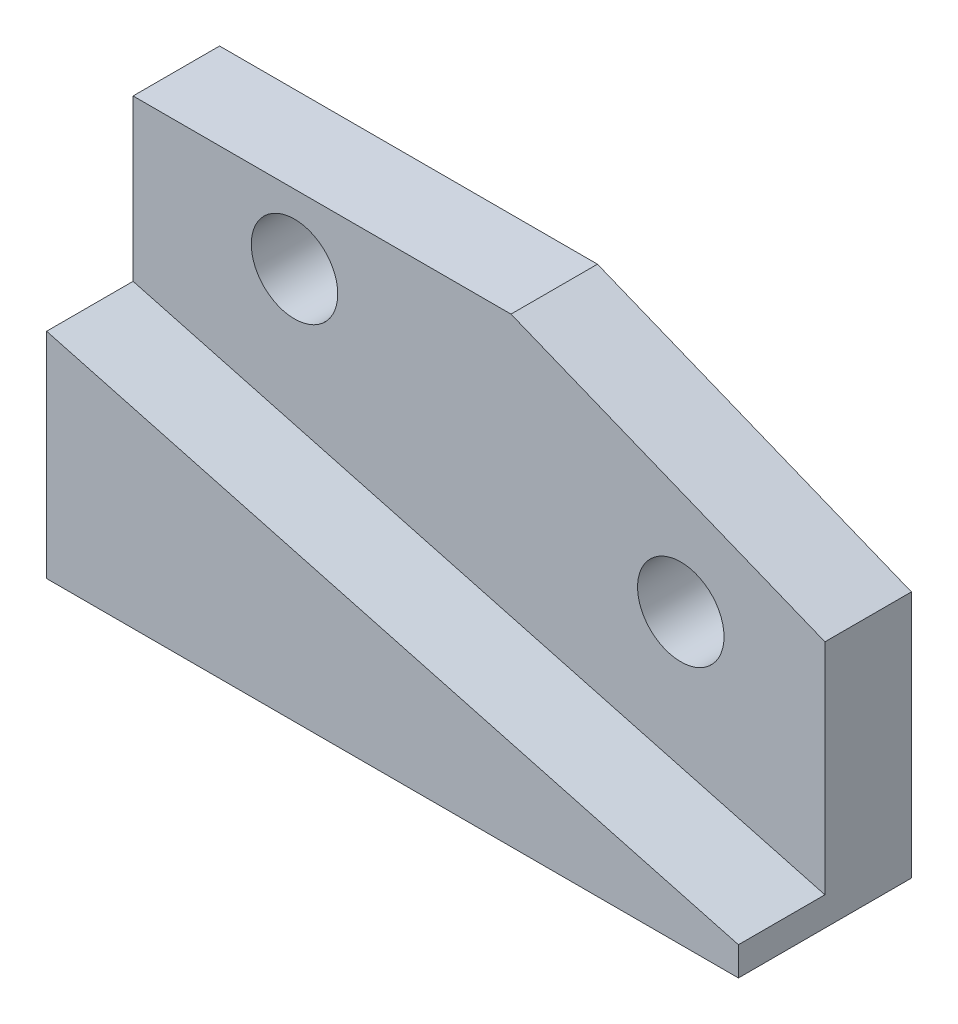
ISO-10303-21;
HEADER;
FILE_DESCRIPTION(('STEP AP214'),'2;1');
FILE_NAME('part.step','',(''),(''),'','','');
FILE_SCHEMA(('AUTOMOTIVE_DESIGN { 1 0 10303 214 1 1 1 1 }'));
ENDSEC;
DATA;
#1=APPLICATION_CONTEXT('core data for automotive mechanical design processes');
#2=APPLICATION_PROTOCOL_DEFINITION('international standard','automotive_design',2000,#1);
#3=PRODUCT_CONTEXT('',#1,'mechanical');
#4=PRODUCT('Part','Part','',(#3));
#5=PRODUCT_RELATED_PRODUCT_CATEGORY('part','',(#4));
#6=PRODUCT_DEFINITION_FORMATION('','',#4);
#7=PRODUCT_DEFINITION_CONTEXT('part definition',#1,'design');
#8=PRODUCT_DEFINITION('design','',#6,#7);
#9=PRODUCT_DEFINITION_SHAPE('','',#8);
#10=(LENGTH_UNIT() NAMED_UNIT(*) SI_UNIT(.MILLI.,.METRE.));
#11=(NAMED_UNIT(*) PLANE_ANGLE_UNIT() SI_UNIT($,.RADIAN.));
#12=(NAMED_UNIT(*) SI_UNIT($,.STERADIAN.) SOLID_ANGLE_UNIT());
#13=UNCERTAINTY_MEASURE_WITH_UNIT(LENGTH_MEASURE(1.E-05),#10,'distance_accuracy_value','');
#14=(GEOMETRIC_REPRESENTATION_CONTEXT(3) GLOBAL_UNCERTAINTY_ASSIGNED_CONTEXT((#13)) GLOBAL_UNIT_ASSIGNED_CONTEXT((#10,
#11,#12)) REPRESENTATION_CONTEXT('',''));
#15=CARTESIAN_POINT('',(0.,0.,0.));
#16=DIRECTION('',(0.,0.,1.));
#17=DIRECTION('',(1.,0.,0.));
#18=AXIS2_PLACEMENT_3D('',#15,#16,#17);
#19=CARTESIAN_POINT('',(-2.85576211353315,-10.657849302036,15.));
#20=DIRECTION('',(-0.258819045102521,-0.965925826289068,0.));
#21=DIRECTION('',(0.965925826289068,-0.258819045102521,0.));
#22=AXIS2_PLACEMENT_3D('',#19,#20,#21);
#23=PLANE('',#22);
#24=DIRECTION('',(-0.965925826289068,0.258819045102521,0.));
#25=VECTOR('',#24,1.);
#26=CARTESIAN_POINT('',(-2.85576211353315,-10.657849302036,0.));
#27=LINE('',#26,#25);
#28=CARTESIAN_POINT('',(60.,-27.5,0.));
#29=VERTEX_POINT('',#28);
#30=CARTESIAN_POINT('',(-60.,4.65390309173481,0.));
#31=VERTEX_POINT('',#30);
#32=EDGE_CURVE('E191',#29,#31,#27,.T.);
#33=ORIENTED_EDGE('',*,*,#32,.T.);
#34=DIRECTION('',(0.,0.,-1.));
#35=VECTOR('',#34,1.);
#36=CARTESIAN_POINT('',(-60.,4.65390309173481,15.));
#37=LINE('',#36,#35);
#38=CARTESIAN_POINT('',(-60.,4.65390309173481,15.));
#39=VERTEX_POINT('',#38);
#40=EDGE_CURVE('E12',#39,#31,#37,.T.);
#41=ORIENTED_EDGE('',*,*,#40,.F.);
#42=DIRECTION('',(-0.965925826289068,0.258819045102521,0.));
#43=VECTOR('',#42,1.);
#44=CARTESIAN_POINT('',(-2.85576211353315,-10.657849302036,15.));
#45=LINE('',#44,#43);
#46=CARTESIAN_POINT('',(60.,-27.5,15.));
#47=VERTEX_POINT('',#46);
#48=EDGE_CURVE('E195',#47,#39,#45,.T.);
#49=ORIENTED_EDGE('',*,*,#48,.F.);
#50=DIRECTION('',(0.,0.,-1.));
#51=VECTOR('',#50,1.);
#52=CARTESIAN_POINT('',(60.,-27.5,15.));
#53=LINE('',#52,#51);
#54=EDGE_CURVE('E95',#47,#29,#53,.T.);
#55=ORIENTED_EDGE('',*,*,#54,.T.);
#56=EDGE_LOOP('',(#33,#41,#49,#55));
#57=FACE_BOUND('',#56,.T.);
#58=ADVANCED_FACE('F79',(#57),#23,.F.);
#59=CARTESIAN_POINT('',(-60.,0.,15.));
#60=DIRECTION('',(1.,0.,0.));
#61=DIRECTION('',(0.,1.,0.));
#62=AXIS2_PLACEMENT_3D('',#59,#60,#61);
#63=PLANE('',#62);
#64=ORIENTED_EDGE('',*,*,#40,.T.);
#65=DIRECTION('',(0.,-1.,0.));
#66=VECTOR('',#65,1.);
#67=CARTESIAN_POINT('',(-60.,32.5,0.));
#68=LINE('',#67,#66);
#69=CARTESIAN_POINT('',(-60.,32.5,0.));
#70=VERTEX_POINT('',#69);
#71=EDGE_CURVE('E141',#70,#31,#68,.T.);
#72=ORIENTED_EDGE('',*,*,#71,.F.);
#73=DIRECTION('',(0.,0.,1.));
#74=VECTOR('',#73,1.);
#75=CARTESIAN_POINT('',(-60.,32.5,-15.));
#76=LINE('',#75,#74);
#77=CARTESIAN_POINT('',(-60.,32.5,-15.));
#78=VERTEX_POINT('',#77);
#79=EDGE_CURVE('E135',#78,#70,#76,.T.);
#80=ORIENTED_EDGE('',*,*,#79,.F.);
#81=DIRECTION('',(0.,-1.,0.));
#82=VECTOR('',#81,1.);
#83=CARTESIAN_POINT('',(-60.,32.5,-15.));
#84=LINE('',#83,#82);
#85=CARTESIAN_POINT('',(-60.,-32.5,-15.));
#86=VERTEX_POINT('',#85);
#87=EDGE_CURVE('E139',#78,#86,#84,.T.);
#88=ORIENTED_EDGE('',*,*,#87,.T.);
#89=DIRECTION('',(0.,0.,-1.));
#90=VECTOR('',#89,1.);
#91=CARTESIAN_POINT('',(-60.,-32.5,15.));
#92=LINE('',#91,#90);
#93=CARTESIAN_POINT('',(-60.,-32.5,15.));
#94=VERTEX_POINT('',#93);
#95=EDGE_CURVE('E88',#94,#86,#92,.T.);
#96=ORIENTED_EDGE('',*,*,#95,.F.);
#97=DIRECTION('',(0.,-1.,0.));
#98=VECTOR('',#97,1.);
#99=CARTESIAN_POINT('',(-60.,0.,15.));
#100=LINE('',#99,#98);
#101=EDGE_CURVE('E199',#39,#94,#100,.T.);
#102=ORIENTED_EDGE('',*,*,#101,.F.);
#103=EDGE_LOOP('',(#64,#72,#80,#88,#96,#102));
#104=FACE_BOUND('',#103,.T.);
#105=ADVANCED_FACE('F137',(#104),#63,.F.);
#106=CARTESIAN_POINT('',(0.,-32.5,15.));
#107=DIRECTION('',(0.,-1.,0.));
#108=DIRECTION('',(1.,0.,0.));
#109=AXIS2_PLACEMENT_3D('',#106,#107,#108);
#110=PLANE('',#109);
#111=ORIENTED_EDGE('',*,*,#95,.T.);
#112=DIRECTION('',(-1.,0.,0.));
#113=VECTOR('',#112,1.);
#114=CARTESIAN_POINT('',(60.,-32.5,-15.));
#115=LINE('',#114,#113);
#116=CARTESIAN_POINT('',(60.,-32.5,-15.));
#117=VERTEX_POINT('',#116);
#118=EDGE_CURVE('E157',#117,#86,#115,.T.);
#119=ORIENTED_EDGE('',*,*,#118,.F.);
#120=DIRECTION('',(0.,0.,-1.));
#121=VECTOR('',#120,1.);
#122=CARTESIAN_POINT('',(60.,-32.5,15.));
#123=LINE('',#122,#121);
#124=CARTESIAN_POINT('',(60.,-32.5,15.));
#125=VERTEX_POINT('',#124);
#126=EDGE_CURVE('E214',#125,#117,#123,.T.);
#127=ORIENTED_EDGE('',*,*,#126,.F.);
#128=DIRECTION('',(-1.,0.,0.));
#129=VECTOR('',#128,1.);
#130=CARTESIAN_POINT('',(0.,-32.5,15.));
#131=LINE('',#130,#129);
#132=EDGE_CURVE('E202',#125,#94,#131,.T.);
#133=ORIENTED_EDGE('',*,*,#132,.T.);
#134=EDGE_LOOP('',(#111,#119,#127,#133));
#135=FACE_BOUND('',#134,.T.);
#136=ADVANCED_FACE('F219',(#135),#110,.T.);
#137=CARTESIAN_POINT('',(60.,0.,15.));
#138=DIRECTION('',(1.,0.,0.));
#139=DIRECTION('',(0.,1.,0.));
#140=AXIS2_PLACEMENT_3D('',#137,#138,#139);
#141=PLANE('',#140);
#142=ORIENTED_EDGE('',*,*,#126,.T.);
#143=DIRECTION('',(0.,-1.,0.));
#144=VECTOR('',#143,1.);
#145=CARTESIAN_POINT('',(60.,10.5,-15.));
#146=LINE('',#145,#144);
#147=CARTESIAN_POINT('',(60.,10.5,-15.));
#148=VERTEX_POINT('',#147);
#149=EDGE_CURVE('E178',#148,#117,#146,.T.);
#150=ORIENTED_EDGE('',*,*,#149,.F.);
#151=DIRECTION('',(0.,0.,1.));
#152=VECTOR('',#151,1.);
#153=CARTESIAN_POINT('',(60.,10.5,-15.));
#154=LINE('',#153,#152);
#155=CARTESIAN_POINT('',(60.,10.5,0.));
#156=VERTEX_POINT('',#155);
#157=EDGE_CURVE('E147',#148,#156,#154,.T.);
#158=ORIENTED_EDGE('',*,*,#157,.T.);
#159=DIRECTION('',(0.,-1.,0.));
#160=VECTOR('',#159,1.);
#161=CARTESIAN_POINT('',(60.,10.5,0.));
#162=LINE('',#161,#160);
#163=EDGE_CURVE('E170',#156,#29,#162,.T.);
#164=ORIENTED_EDGE('',*,*,#163,.T.);
#165=ORIENTED_EDGE('',*,*,#54,.F.);
#166=DIRECTION('',(0.,-1.,0.));
#167=VECTOR('',#166,1.);
#168=CARTESIAN_POINT('',(60.,0.,15.));
#169=LINE('',#168,#167);
#170=EDGE_CURVE('E206',#47,#125,#169,.T.);
#171=ORIENTED_EDGE('',*,*,#170,.T.);
#172=EDGE_LOOP('',(#142,#150,#158,#164,#165,#171));
#173=FACE_BOUND('',#172,.T.);
#174=ADVANCED_FACE('F230',(#173),#141,.T.);
#175=CARTESIAN_POINT('',(0.,0.,15.));
#176=DIRECTION('',(0.,0.,1.));
#177=DIRECTION('',(1.,0.,0.));
#178=AXIS2_PLACEMENT_3D('',#175,#176,#177);
#179=PLANE('',#178);
#180=ORIENTED_EDGE('',*,*,#48,.T.);
#181=ORIENTED_EDGE('',*,*,#101,.T.);
#182=ORIENTED_EDGE('',*,*,#132,.F.);
#183=ORIENTED_EDGE('',*,*,#170,.F.);
#184=EDGE_LOOP('',(#180,#181,#182,#183));
#185=FACE_BOUND('',#184,.T.);
#186=ADVANCED_FACE('F224',(#185),#179,.T.);
#187=CARTESIAN_POINT('',(0.,0.,0.));
#188=DIRECTION('',(0.,0.,1.));
#189=DIRECTION('',(1.,0.,0.));
#190=AXIS2_PLACEMENT_3D('',#187,#188,#189);
#191=PLANE('',#190);
#192=CARTESIAN_POINT('',(-32.,20.5,0.));
#193=DIRECTION('',(0.,0.,1.));
#194=DIRECTION('',(1.,0.,0.));
#195=AXIS2_PLACEMENT_3D('',#192,#193,#194);
#196=CIRCLE('',#195,7.5);
#197=CARTESIAN_POINT('',(-24.5,20.5,0.));
#198=VERTEX_POINT('',#197);
#199=EDGE_CURVE('E173',#198,#198,#196,.T.);
#200=ORIENTED_EDGE('',*,*,#199,.F.);
#201=EDGE_LOOP('',(#200));
#202=FACE_BOUND('',#201,.T.);
#203=CARTESIAN_POINT('',(35.,2.50000000000001,0.));
#204=DIRECTION('',(0.,0.,1.));
#205=DIRECTION('',(1.,0.,0.));
#206=AXIS2_PLACEMENT_3D('',#203,#204,#205);
#207=CIRCLE('',#206,7.5);
#208=CARTESIAN_POINT('',(42.5,2.50000000000001,0.));
#209=VERTEX_POINT('',#208);
#210=EDGE_CURVE('E281',#209,#209,#207,.T.);
#211=ORIENTED_EDGE('',*,*,#210,.F.);
#212=EDGE_LOOP('',(#211));
#213=FACE_BOUND('',#212,.T.);
#214=ORIENTED_EDGE('',*,*,#32,.F.);
#215=ORIENTED_EDGE('',*,*,#163,.F.);
#216=DIRECTION('',(0.927183854566786,-0.374606593415914,0.));
#217=VECTOR('',#216,1.);
#218=CARTESIAN_POINT('',(5.54808922484191,32.5,0.));
#219=LINE('',#218,#217);
#220=CARTESIAN_POINT('',(5.54808922484191,32.5,0.));
#221=VERTEX_POINT('',#220);
#222=EDGE_CURVE('E164',#221,#156,#219,.T.);
#223=ORIENTED_EDGE('',*,*,#222,.F.);
#224=DIRECTION('',(-1.,0.,0.));
#225=VECTOR('',#224,1.);
#226=CARTESIAN_POINT('',(5.54808922484191,32.5,0.));
#227=LINE('',#226,#225);
#228=EDGE_CURVE('E182',#221,#70,#227,.T.);
#229=ORIENTED_EDGE('',*,*,#228,.T.);
#230=ORIENTED_EDGE('',*,*,#71,.T.);
#231=EDGE_LOOP('',(#214,#215,#223,#229,#230));
#232=FACE_BOUND('',#231,.T.);
#233=ADVANCED_FACE('F228',(#202,#213,#232),#191,.T.);
#234=CARTESIAN_POINT('',(5.54808922484191,32.5,-15.));
#235=DIRECTION('',(0.,1.,0.));
#236=DIRECTION('',(-1.,0.,0.));
#237=AXIS2_PLACEMENT_3D('',#234,#235,#236);
#238=PLANE('',#237);
#239=ORIENTED_EDGE('',*,*,#228,.F.);
#240=DIRECTION('',(0.,0.,1.));
#241=VECTOR('',#240,1.);
#242=CARTESIAN_POINT('',(5.54808922484191,32.5,-15.));
#243=LINE('',#242,#241);
#244=CARTESIAN_POINT('',(5.54808922484191,32.5,-15.));
#245=VERTEX_POINT('',#244);
#246=EDGE_CURVE('E161',#245,#221,#243,.T.);
#247=ORIENTED_EDGE('',*,*,#246,.F.);
#248=DIRECTION('',(-1.,0.,0.));
#249=VECTOR('',#248,1.);
#250=CARTESIAN_POINT('',(5.54808922484191,32.5,-15.));
#251=LINE('',#250,#249);
#252=EDGE_CURVE('E154',#245,#78,#251,.T.);
#253=ORIENTED_EDGE('',*,*,#252,.T.);
#254=ORIENTED_EDGE('',*,*,#79,.T.);
#255=EDGE_LOOP('',(#239,#247,#253,#254));
#256=FACE_BOUND('',#255,.T.);
#257=ADVANCED_FACE('F160',(#256),#238,.T.);
#258=CARTESIAN_POINT('',(5.54808922484191,32.5,-15.));
#259=DIRECTION('',(-0.374606593415914,-0.927183854566787,0.));
#260=DIRECTION('',(0.927183854566787,-0.374606593415914,0.));
#261=AXIS2_PLACEMENT_3D('',#258,#259,#260);
#262=PLANE('',#261);
#263=ORIENTED_EDGE('',*,*,#222,.T.);
#264=ORIENTED_EDGE('',*,*,#157,.F.);
#265=DIRECTION('',(0.927183854566786,-0.374606593415914,0.));
#266=VECTOR('',#265,1.);
#267=CARTESIAN_POINT('',(5.54808922484191,32.5,-15.));
#268=LINE('',#267,#266);
#269=EDGE_CURVE('E148',#245,#148,#268,.T.);
#270=ORIENTED_EDGE('',*,*,#269,.F.);
#271=ORIENTED_EDGE('',*,*,#246,.T.);
#272=EDGE_LOOP('',(#263,#264,#270,#271));
#273=FACE_BOUND('',#272,.T.);
#274=ADVANCED_FACE('F234',(#273),#262,.F.);
#275=CARTESIAN_POINT('',(0.,0.,-15.));
#276=DIRECTION('',(0.,0.,1.));
#277=DIRECTION('',(1.,0.,0.));
#278=AXIS2_PLACEMENT_3D('',#275,#276,#277);
#279=PLANE('',#278);
#280=CARTESIAN_POINT('',(35.,2.50000000000001,-15.));
#281=DIRECTION('',(0.,0.,1.));
#282=DIRECTION('',(1.,0.,0.));
#283=AXIS2_PLACEMENT_3D('',#280,#281,#282);
#284=CIRCLE('',#283,7.5);
#285=CARTESIAN_POINT('',(42.5,2.50000000000001,-15.));
#286=VERTEX_POINT('',#285);
#287=EDGE_CURVE('E278',#286,#286,#284,.T.);
#288=ORIENTED_EDGE('',*,*,#287,.T.);
#289=EDGE_LOOP('',(#288));
#290=FACE_BOUND('',#289,.T.);
#291=CARTESIAN_POINT('',(-32.,20.5,-15.));
#292=DIRECTION('',(0.,0.,1.));
#293=DIRECTION('',(1.,0.,0.));
#294=AXIS2_PLACEMENT_3D('',#291,#292,#293);
#295=CIRCLE('',#294,7.5);
#296=CARTESIAN_POINT('',(-24.5,20.5,-15.));
#297=VERTEX_POINT('',#296);
#298=EDGE_CURVE('E185',#297,#297,#295,.T.);
#299=ORIENTED_EDGE('',*,*,#298,.T.);
#300=EDGE_LOOP('',(#299));
#301=FACE_BOUND('',#300,.T.);
#302=ORIENTED_EDGE('',*,*,#252,.F.);
#303=ORIENTED_EDGE('',*,*,#269,.T.);
#304=ORIENTED_EDGE('',*,*,#149,.T.);
#305=ORIENTED_EDGE('',*,*,#118,.T.);
#306=ORIENTED_EDGE('',*,*,#87,.F.);
#307=EDGE_LOOP('',(#302,#303,#304,#305,#306));
#308=FACE_BOUND('',#307,.T.);
#309=ADVANCED_FACE('F153',(#290,#301,#308),#279,.F.);
#310=CARTESIAN_POINT('',(-32.,20.5,-15.));
#311=DIRECTION('',(0.,0.,1.));
#312=DIRECTION('',(1.,0.,0.));
#313=AXIS2_PLACEMENT_3D('',#310,#311,#312);
#314=CYLINDRICAL_SURFACE('',#313,7.5);
#315=ORIENTED_EDGE('',*,*,#298,.F.);
#316=EDGE_LOOP('',(#315));
#317=FACE_BOUND('',#316,.T.);
#318=ORIENTED_EDGE('',*,*,#199,.T.);
#319=EDGE_LOOP('',(#318));
#320=FACE_BOUND('',#319,.T.);
#321=ADVANCED_FACE('F241',(#317,#320),#314,.F.);
#322=CARTESIAN_POINT('',(35.,2.50000000000001,-15.));
#323=DIRECTION('',(0.,0.,1.));
#324=DIRECTION('',(1.,0.,0.));
#325=AXIS2_PLACEMENT_3D('',#322,#323,#324);
#326=CYLINDRICAL_SURFACE('',#325,7.5);
#327=ORIENTED_EDGE('',*,*,#287,.F.);
#328=EDGE_LOOP('',(#327));
#329=FACE_BOUND('',#328,.T.);
#330=ORIENTED_EDGE('',*,*,#210,.T.);
#331=EDGE_LOOP('',(#330));
#332=FACE_BOUND('',#331,.T.);
#333=ADVANCED_FACE('F269',(#329,#332),#326,.F.);
#334=CLOSED_SHELL('',(#58,#105,#136,#174,#186,#233,#257,#274,#309,#321,#333));
#335=MANIFOLD_SOLID_BREP('B2',#334);
#336=ADVANCED_BREP_SHAPE_REPRESENTATION('',(#18,#335),#14);
#337=SHAPE_DEFINITION_REPRESENTATION(#9,#336);
ENDSEC;
END-ISO-10303-21;
